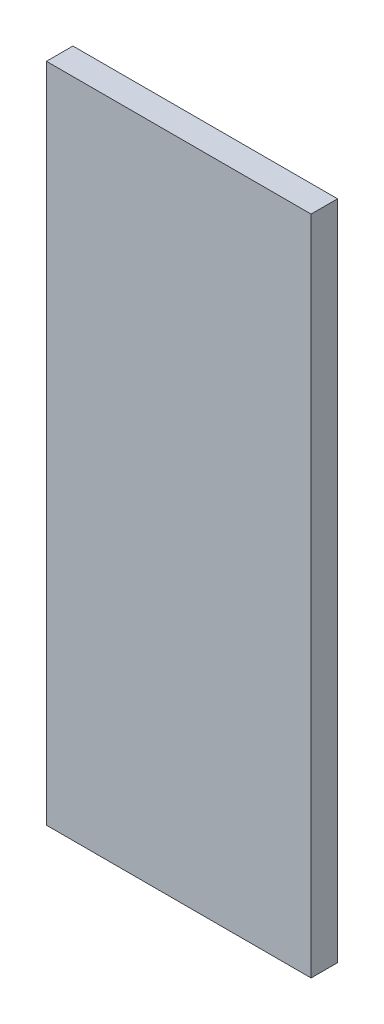
ISO-10303-21;
HEADER;
FILE_DESCRIPTION(('STEP AP214'),'2;1');
FILE_NAME('part.step','',(''),(''),'','','');
FILE_SCHEMA(('AUTOMOTIVE_DESIGN { 1 0 10303 214 1 1 1 1 }'));
ENDSEC;
DATA;
#1=APPLICATION_CONTEXT('core data for automotive mechanical design processes');
#2=APPLICATION_PROTOCOL_DEFINITION('international standard','automotive_design',2000,#1);
#3=PRODUCT_CONTEXT('',#1,'mechanical');
#4=PRODUCT('Part','Part','',(#3));
#5=PRODUCT_RELATED_PRODUCT_CATEGORY('part','',(#4));
#6=PRODUCT_DEFINITION_FORMATION('','',#4);
#7=PRODUCT_DEFINITION_CONTEXT('part definition',#1,'design');
#8=PRODUCT_DEFINITION('design','',#6,#7);
#9=PRODUCT_DEFINITION_SHAPE('','',#8);
#10=(LENGTH_UNIT() NAMED_UNIT(*) SI_UNIT(.MILLI.,.METRE.));
#11=(NAMED_UNIT(*) PLANE_ANGLE_UNIT() SI_UNIT($,.RADIAN.));
#12=(NAMED_UNIT(*) SI_UNIT($,.STERADIAN.) SOLID_ANGLE_UNIT());
#13=UNCERTAINTY_MEASURE_WITH_UNIT(LENGTH_MEASURE(1.E-05),#10,'distance_accuracy_value','');
#14=(GEOMETRIC_REPRESENTATION_CONTEXT(3) GLOBAL_UNCERTAINTY_ASSIGNED_CONTEXT((#13)) GLOBAL_UNIT_ASSIGNED_CONTEXT((#10,
#11,#12)) REPRESENTATION_CONTEXT('',''));
#15=CARTESIAN_POINT('',(0.,0.,0.));
#16=DIRECTION('',(0.,0.,1.));
#17=DIRECTION('',(1.,0.,0.));
#18=AXIS2_PLACEMENT_3D('',#15,#16,#17);
#19=CARTESIAN_POINT('',(0.,50.,0.));
#20=DIRECTION('',(1.,0.,0.));
#21=DIRECTION('',(0.,0.,-1.));
#22=AXIS2_PLACEMENT_3D('',#19,#20,#21);
#23=PLANE('',#22);
#24=DIRECTION('',(0.,0.,1.));
#25=VECTOR('',#24,1.);
#26=CARTESIAN_POINT('',(0.,0.,0.));
#27=LINE('',#26,#25);
#28=CARTESIAN_POINT('',(0.,0.,-2.));
#29=VERTEX_POINT('',#28);
#30=CARTESIAN_POINT('',(0.,0.,0.));
#31=VERTEX_POINT('',#30);
#32=EDGE_CURVE('E97',#29,#31,#27,.T.);
#33=ORIENTED_EDGE('',*,*,#32,.T.);
#34=DIRECTION('',(0.,-1.,0.));
#35=VECTOR('',#34,1.);
#36=CARTESIAN_POINT('',(0.,50.,0.));
#37=LINE('',#36,#35);
#38=CARTESIAN_POINT('',(0.,50.,0.));
#39=VERTEX_POINT('',#38);
#40=EDGE_CURVE('E11',#39,#31,#37,.T.);
#41=ORIENTED_EDGE('',*,*,#40,.F.);
#42=DIRECTION('',(0.,0.,1.));
#43=VECTOR('',#42,1.);
#44=CARTESIAN_POINT('',(0.,50.,0.));
#45=LINE('',#44,#43);
#46=CARTESIAN_POINT('',(0.,50.,-2.));
#47=VERTEX_POINT('',#46);
#48=EDGE_CURVE('E85',#47,#39,#45,.T.);
#49=ORIENTED_EDGE('',*,*,#48,.F.);
#50=DIRECTION('',(0.,-1.,0.));
#51=VECTOR('',#50,1.);
#52=CARTESIAN_POINT('',(0.,50.,-2.));
#53=LINE('',#52,#51);
#54=EDGE_CURVE('E93',#47,#29,#53,.T.);
#55=ORIENTED_EDGE('',*,*,#54,.T.);
#56=EDGE_LOOP('',(#33,#41,#49,#55));
#57=FACE_BOUND('',#56,.T.);
#58=ADVANCED_FACE('F34',(#57),#23,.F.);
#59=CARTESIAN_POINT('',(0.,50.,0.));
#60=DIRECTION('',(0.,0.,-1.));
#61=DIRECTION('',(-1.,0.,0.));
#62=AXIS2_PLACEMENT_3D('',#59,#60,#61);
#63=PLANE('',#62);
#64=DIRECTION('',(1.,0.,0.));
#65=VECTOR('',#64,1.);
#66=CARTESIAN_POINT('',(0.,0.,0.));
#67=LINE('',#66,#65);
#68=CARTESIAN_POINT('',(20.,0.,0.));
#69=VERTEX_POINT('',#68);
#70=EDGE_CURVE('E89',#31,#69,#67,.T.);
#71=ORIENTED_EDGE('',*,*,#70,.T.);
#72=DIRECTION('',(0.,-1.,0.));
#73=VECTOR('',#72,1.);
#74=CARTESIAN_POINT('',(20.,50.,0.));
#75=LINE('',#74,#73);
#76=CARTESIAN_POINT('',(20.,50.,0.));
#77=VERTEX_POINT('',#76);
#78=EDGE_CURVE('E42',#77,#69,#75,.T.);
#79=ORIENTED_EDGE('',*,*,#78,.F.);
#80=DIRECTION('',(1.,0.,0.));
#81=VECTOR('',#80,1.);
#82=CARTESIAN_POINT('',(0.,50.,0.));
#83=LINE('',#82,#81);
#84=EDGE_CURVE('E80',#39,#77,#83,.T.);
#85=ORIENTED_EDGE('',*,*,#84,.F.);
#86=ORIENTED_EDGE('',*,*,#40,.T.);
#87=EDGE_LOOP('',(#71,#79,#85,#86));
#88=FACE_BOUND('',#87,.T.);
#89=ADVANCED_FACE('F88',(#88),#63,.F.);
#90=CARTESIAN_POINT('',(20.,50.,0.));
#91=DIRECTION('',(-1.,0.,0.));
#92=DIRECTION('',(0.,0.,1.));
#93=AXIS2_PLACEMENT_3D('',#90,#91,#92);
#94=PLANE('',#93);
#95=DIRECTION('',(0.,0.,-1.));
#96=VECTOR('',#95,1.);
#97=CARTESIAN_POINT('',(20.,0.,0.));
#98=LINE('',#97,#96);
#99=CARTESIAN_POINT('',(20.,0.,-2.));
#100=VERTEX_POINT('',#99);
#101=EDGE_CURVE('E67',#69,#100,#98,.T.);
#102=ORIENTED_EDGE('',*,*,#101,.T.);
#103=DIRECTION('',(0.,-1.,0.));
#104=VECTOR('',#103,1.);
#105=CARTESIAN_POINT('',(20.,50.,-2.));
#106=LINE('',#105,#104);
#107=CARTESIAN_POINT('',(20.,50.,-2.));
#108=VERTEX_POINT('',#107);
#109=EDGE_CURVE('E90',#108,#100,#106,.T.);
#110=ORIENTED_EDGE('',*,*,#109,.F.);
#111=DIRECTION('',(0.,0.,-1.));
#112=VECTOR('',#111,1.);
#113=CARTESIAN_POINT('',(20.,50.,0.));
#114=LINE('',#113,#112);
#115=EDGE_CURVE('E83',#77,#108,#114,.T.);
#116=ORIENTED_EDGE('',*,*,#115,.F.);
#117=ORIENTED_EDGE('',*,*,#78,.T.);
#118=EDGE_LOOP('',(#102,#110,#116,#117));
#119=FACE_BOUND('',#118,.T.);
#120=ADVANCED_FACE('F91',(#119),#94,.F.);
#121=CARTESIAN_POINT('',(0.,50.,-2.));
#122=DIRECTION('',(0.,0.,1.));
#123=DIRECTION('',(1.,0.,0.));
#124=AXIS2_PLACEMENT_3D('',#121,#122,#123);
#125=PLANE('',#124);
#126=DIRECTION('',(-1.,0.,0.));
#127=VECTOR('',#126,1.);
#128=CARTESIAN_POINT('',(0.,0.,-2.));
#129=LINE('',#128,#127);
#130=EDGE_CURVE('E73',#100,#29,#129,.T.);
#131=ORIENTED_EDGE('',*,*,#130,.T.);
#132=ORIENTED_EDGE('',*,*,#54,.F.);
#133=DIRECTION('',(-1.,0.,0.));
#134=VECTOR('',#133,1.);
#135=CARTESIAN_POINT('',(0.,50.,-2.));
#136=LINE('',#135,#134);
#137=EDGE_CURVE('E50',#108,#47,#136,.T.);
#138=ORIENTED_EDGE('',*,*,#137,.F.);
#139=ORIENTED_EDGE('',*,*,#109,.T.);
#140=EDGE_LOOP('',(#131,#132,#138,#139));
#141=FACE_BOUND('',#140,.T.);
#142=ADVANCED_FACE('F104',(#141),#125,.F.);
#143=CARTESIAN_POINT('',(0.,50.,0.));
#144=DIRECTION('',(0.,-1.,0.));
#145=DIRECTION('',(0.,0.,-1.));
#146=AXIS2_PLACEMENT_3D('',#143,#144,#145);
#147=PLANE('',#146);
#148=ORIENTED_EDGE('',*,*,#48,.T.);
#149=ORIENTED_EDGE('',*,*,#84,.T.);
#150=ORIENTED_EDGE('',*,*,#115,.T.);
#151=ORIENTED_EDGE('',*,*,#137,.T.);
#152=EDGE_LOOP('',(#148,#149,#150,#151));
#153=FACE_BOUND('',#152,.T.);
#154=ADVANCED_FACE('F81',(#153),#147,.F.);
#155=CARTESIAN_POINT('',(0.,0.,0.));
#156=DIRECTION('',(0.,-1.,0.));
#157=DIRECTION('',(0.,0.,-1.));
#158=AXIS2_PLACEMENT_3D('',#155,#156,#157);
#159=PLANE('',#158);
#160=ORIENTED_EDGE('',*,*,#32,.F.);
#161=ORIENTED_EDGE('',*,*,#130,.F.);
#162=ORIENTED_EDGE('',*,*,#101,.F.);
#163=ORIENTED_EDGE('',*,*,#70,.F.);
#164=EDGE_LOOP('',(#160,#161,#162,#163));
#165=FACE_BOUND('',#164,.T.);
#166=ADVANCED_FACE('F107',(#165),#159,.T.);
#167=CLOSED_SHELL('',(#58,#89,#120,#142,#154,#166));
#168=MANIFOLD_SOLID_BREP('B2',#167);
#169=ADVANCED_BREP_SHAPE_REPRESENTATION('',(#18,#168),#14);
#170=SHAPE_DEFINITION_REPRESENTATION(#9,#169);
ENDSEC;
END-ISO-10303-21;
